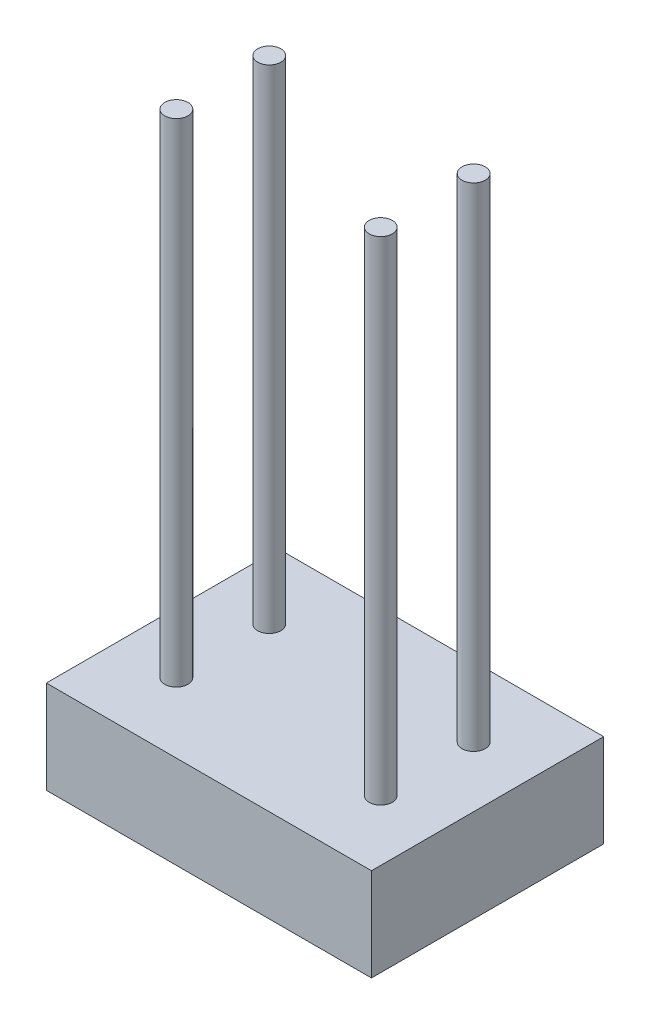
ISO-10303-21;
HEADER;
FILE_DESCRIPTION(('STEP AP214'),'2;1');
FILE_NAME('part.step','',(''),(''),'','','');
FILE_SCHEMA(('AUTOMOTIVE_DESIGN { 1 0 10303 214 1 1 1 1 }'));
ENDSEC;
DATA;
#1=APPLICATION_CONTEXT('core data for automotive mechanical design processes');
#2=APPLICATION_PROTOCOL_DEFINITION('international standard','automotive_design',2000,#1);
#3=PRODUCT_CONTEXT('',#1,'mechanical');
#4=PRODUCT('Part','Part','',(#3));
#5=PRODUCT_RELATED_PRODUCT_CATEGORY('part','',(#4));
#6=PRODUCT_DEFINITION_FORMATION('','',#4);
#7=PRODUCT_DEFINITION_CONTEXT('part definition',#1,'design');
#8=PRODUCT_DEFINITION('design','',#6,#7);
#9=PRODUCT_DEFINITION_SHAPE('','',#8);
#10=(LENGTH_UNIT() NAMED_UNIT(*) SI_UNIT(.MILLI.,.METRE.));
#11=(NAMED_UNIT(*) PLANE_ANGLE_UNIT() SI_UNIT($,.RADIAN.));
#12=(NAMED_UNIT(*) SI_UNIT($,.STERADIAN.) SOLID_ANGLE_UNIT());
#13=UNCERTAINTY_MEASURE_WITH_UNIT(LENGTH_MEASURE(1.E-05),#10,'distance_accuracy_value','');
#14=(GEOMETRIC_REPRESENTATION_CONTEXT(3) GLOBAL_UNCERTAINTY_ASSIGNED_CONTEXT((#13)) GLOBAL_UNIT_ASSIGNED_CONTEXT((#10,
#11,#12)) REPRESENTATION_CONTEXT('',''));
#15=CARTESIAN_POINT('',(0.,0.,0.));
#16=DIRECTION('',(0.,0.,1.));
#17=DIRECTION('',(1.,0.,0.));
#18=AXIS2_PLACEMENT_3D('',#15,#16,#17);
#19=CARTESIAN_POINT('',(175.,100.,-125.));
#20=DIRECTION('',(-1.,0.,0.));
#21=DIRECTION('',(0.,0.,1.));
#22=AXIS2_PLACEMENT_3D('',#19,#20,#21);
#23=PLANE('',#22);
#24=DIRECTION('',(0.,0.,-1.));
#25=VECTOR('',#24,1.);
#26=CARTESIAN_POINT('',(175.,0.,-125.));
#27=LINE('',#26,#25);
#28=CARTESIAN_POINT('',(175.,0.,125.));
#29=VERTEX_POINT('',#28);
#30=CARTESIAN_POINT('',(175.,0.,-125.));
#31=VERTEX_POINT('',#30);
#32=EDGE_CURVE('E101',#29,#31,#27,.T.);
#33=ORIENTED_EDGE('',*,*,#32,.T.);
#34=DIRECTION('',(0.,-1.,0.));
#35=VECTOR('',#34,1.);
#36=CARTESIAN_POINT('',(175.,100.,-125.));
#37=LINE('',#36,#35);
#38=CARTESIAN_POINT('',(175.,100.,-125.));
#39=VERTEX_POINT('',#38);
#40=EDGE_CURVE('E11',#39,#31,#37,.T.);
#41=ORIENTED_EDGE('',*,*,#40,.F.);
#42=DIRECTION('',(0.,0.,-1.));
#43=VECTOR('',#42,1.);
#44=CARTESIAN_POINT('',(175.,100.,-125.));
#45=LINE('',#44,#43);
#46=CARTESIAN_POINT('',(175.,100.,125.));
#47=VERTEX_POINT('',#46);
#48=EDGE_CURVE('E89',#47,#39,#45,.T.);
#49=ORIENTED_EDGE('',*,*,#48,.F.);
#50=DIRECTION('',(0.,-1.,0.));
#51=VECTOR('',#50,1.);
#52=CARTESIAN_POINT('',(175.,100.,125.));
#53=LINE('',#52,#51);
#54=EDGE_CURVE('E97',#47,#29,#53,.T.);
#55=ORIENTED_EDGE('',*,*,#54,.T.);
#56=EDGE_LOOP('',(#33,#41,#49,#55));
#57=FACE_BOUND('',#56,.T.);
#58=ADVANCED_FACE('F38',(#57),#23,.F.);
#59=CARTESIAN_POINT('',(-175.,100.,-125.));
#60=DIRECTION('',(0.,0.,1.));
#61=DIRECTION('',(1.,0.,0.));
#62=AXIS2_PLACEMENT_3D('',#59,#60,#61);
#63=PLANE('',#62);
#64=DIRECTION('',(-1.,0.,0.));
#65=VECTOR('',#64,1.);
#66=CARTESIAN_POINT('',(-175.,0.,-125.));
#67=LINE('',#66,#65);
#68=CARTESIAN_POINT('',(-175.,0.,-125.));
#69=VERTEX_POINT('',#68);
#70=EDGE_CURVE('E93',#31,#69,#67,.T.);
#71=ORIENTED_EDGE('',*,*,#70,.T.);
#72=DIRECTION('',(0.,-1.,0.));
#73=VECTOR('',#72,1.);
#74=CARTESIAN_POINT('',(-175.,100.,-125.));
#75=LINE('',#74,#73);
#76=CARTESIAN_POINT('',(-175.,100.,-125.));
#77=VERTEX_POINT('',#76);
#78=EDGE_CURVE('E46',#77,#69,#75,.T.);
#79=ORIENTED_EDGE('',*,*,#78,.F.);
#80=DIRECTION('',(-1.,0.,0.));
#81=VECTOR('',#80,1.);
#82=CARTESIAN_POINT('',(-175.,100.,-125.));
#83=LINE('',#82,#81);
#84=EDGE_CURVE('E84',#39,#77,#83,.T.);
#85=ORIENTED_EDGE('',*,*,#84,.F.);
#86=ORIENTED_EDGE('',*,*,#40,.T.);
#87=EDGE_LOOP('',(#71,#79,#85,#86));
#88=FACE_BOUND('',#87,.T.);
#89=ADVANCED_FACE('F92',(#88),#63,.F.);
#90=CARTESIAN_POINT('',(-175.,100.,-125.));
#91=DIRECTION('',(1.,0.,0.));
#92=DIRECTION('',(0.,0.,-1.));
#93=AXIS2_PLACEMENT_3D('',#90,#91,#92);
#94=PLANE('',#93);
#95=DIRECTION('',(0.,0.,1.));
#96=VECTOR('',#95,1.);
#97=CARTESIAN_POINT('',(-175.,0.,-125.));
#98=LINE('',#97,#96);
#99=CARTESIAN_POINT('',(-175.,0.,125.));
#100=VERTEX_POINT('',#99);
#101=EDGE_CURVE('E71',#69,#100,#98,.T.);
#102=ORIENTED_EDGE('',*,*,#101,.T.);
#103=DIRECTION('',(0.,-1.,0.));
#104=VECTOR('',#103,1.);
#105=CARTESIAN_POINT('',(-175.,100.,125.));
#106=LINE('',#105,#104);
#107=CARTESIAN_POINT('',(-175.,100.,125.));
#108=VERTEX_POINT('',#107);
#109=EDGE_CURVE('E94',#108,#100,#106,.T.);
#110=ORIENTED_EDGE('',*,*,#109,.F.);
#111=DIRECTION('',(0.,0.,1.));
#112=VECTOR('',#111,1.);
#113=CARTESIAN_POINT('',(-175.,100.,-125.));
#114=LINE('',#113,#112);
#115=EDGE_CURVE('E87',#77,#108,#114,.T.);
#116=ORIENTED_EDGE('',*,*,#115,.F.);
#117=ORIENTED_EDGE('',*,*,#78,.T.);
#118=EDGE_LOOP('',(#102,#110,#116,#117));
#119=FACE_BOUND('',#118,.T.);
#120=ADVANCED_FACE('F95',(#119),#94,.F.);
#121=CARTESIAN_POINT('',(-175.,100.,125.));
#122=DIRECTION('',(0.,0.,-1.));
#123=DIRECTION('',(-1.,0.,0.));
#124=AXIS2_PLACEMENT_3D('',#121,#122,#123);
#125=PLANE('',#124);
#126=DIRECTION('',(1.,0.,0.));
#127=VECTOR('',#126,1.);
#128=CARTESIAN_POINT('',(-175.,0.,125.));
#129=LINE('',#128,#127);
#130=EDGE_CURVE('E77',#100,#29,#129,.T.);
#131=ORIENTED_EDGE('',*,*,#130,.T.);
#132=ORIENTED_EDGE('',*,*,#54,.F.);
#133=DIRECTION('',(1.,0.,0.));
#134=VECTOR('',#133,1.);
#135=CARTESIAN_POINT('',(-175.,100.,125.));
#136=LINE('',#135,#134);
#137=EDGE_CURVE('E54',#108,#47,#136,.T.);
#138=ORIENTED_EDGE('',*,*,#137,.F.);
#139=ORIENTED_EDGE('',*,*,#109,.T.);
#140=EDGE_LOOP('',(#131,#132,#138,#139));
#141=FACE_BOUND('',#140,.T.);
#142=ADVANCED_FACE('F109',(#141),#125,.F.);
#143=CARTESIAN_POINT('',(0.,100.,0.));
#144=DIRECTION('',(0.,1.,0.));
#145=DIRECTION('',(0.,0.,1.));
#146=AXIS2_PLACEMENT_3D('',#143,#144,#145);
#147=PLANE('',#146);
#148=CARTESIAN_POINT('',(-110.,100.,50.));
#149=DIRECTION('',(0.,1.,0.));
#150=DIRECTION('',(0.,0.,-1.));
#151=AXIS2_PLACEMENT_3D('',#148,#149,#150);
#152=CIRCLE('',#151,12.5);
#153=CARTESIAN_POINT('',(-110.,100.,37.5));
#154=VERTEX_POINT('',#153);
#155=EDGE_CURVE('E133',#154,#154,#152,.T.);
#156=ORIENTED_EDGE('',*,*,#155,.F.);
#157=EDGE_LOOP('',(#156));
#158=FACE_BOUND('',#157,.T.);
#159=CARTESIAN_POINT('',(110.,100.,50.));
#160=DIRECTION('',(0.,1.,0.));
#161=DIRECTION('',(0.,0.,1.));
#162=AXIS2_PLACEMENT_3D('',#159,#160,#161);
#163=CIRCLE('',#162,12.5);
#164=CARTESIAN_POINT('',(110.,100.,62.5));
#165=VERTEX_POINT('',#164);
#166=EDGE_CURVE('E127',#165,#165,#163,.T.);
#167=ORIENTED_EDGE('',*,*,#166,.F.);
#168=EDGE_LOOP('',(#167));
#169=FACE_BOUND('',#168,.T.);
#170=CARTESIAN_POINT('',(110.,100.,-50.));
#171=DIRECTION('',(0.,1.,0.));
#172=DIRECTION('',(0.,0.,-1.));
#173=AXIS2_PLACEMENT_3D('',#170,#171,#172);
#174=CIRCLE('',#173,12.5);
#175=CARTESIAN_POINT('',(110.,100.,-62.5));
#176=VERTEX_POINT('',#175);
#177=EDGE_CURVE('E121',#176,#176,#174,.T.);
#178=ORIENTED_EDGE('',*,*,#177,.F.);
#179=EDGE_LOOP('',(#178));
#180=FACE_BOUND('',#179,.T.);
#181=CARTESIAN_POINT('',(-110.,100.,-50.));
#182=DIRECTION('',(0.,1.,0.));
#183=DIRECTION('',(0.,0.,1.));
#184=AXIS2_PLACEMENT_3D('',#181,#182,#183);
#185=CIRCLE('',#184,12.5);
#186=CARTESIAN_POINT('',(-110.,100.,-37.5));
#187=VERTEX_POINT('',#186);
#188=EDGE_CURVE('E115',#187,#187,#185,.T.);
#189=ORIENTED_EDGE('',*,*,#188,.F.);
#190=EDGE_LOOP('',(#189));
#191=FACE_BOUND('',#190,.T.);
#192=ORIENTED_EDGE('',*,*,#48,.T.);
#193=ORIENTED_EDGE('',*,*,#84,.T.);
#194=ORIENTED_EDGE('',*,*,#115,.T.);
#195=ORIENTED_EDGE('',*,*,#137,.T.);
#196=EDGE_LOOP('',(#192,#193,#194,#195));
#197=FACE_BOUND('',#196,.T.);
#198=ADVANCED_FACE('F85',(#158,#169,#180,#191,#197),#147,.T.);
#199=CARTESIAN_POINT('',(0.,0.,0.));
#200=DIRECTION('',(0.,1.,0.));
#201=DIRECTION('',(0.,0.,1.));
#202=AXIS2_PLACEMENT_3D('',#199,#200,#201);
#203=PLANE('',#202);
#204=ORIENTED_EDGE('',*,*,#32,.F.);
#205=ORIENTED_EDGE('',*,*,#130,.F.);
#206=ORIENTED_EDGE('',*,*,#101,.F.);
#207=ORIENTED_EDGE('',*,*,#70,.F.);
#208=EDGE_LOOP('',(#204,#205,#206,#207));
#209=FACE_BOUND('',#208,.T.);
#210=ADVANCED_FACE('F112',(#209),#203,.F.);
#211=CARTESIAN_POINT('',(-110.,630.,-50.));
#212=DIRECTION('',(0.,-1.,0.));
#213=DIRECTION('',(0.,0.,-1.));
#214=AXIS2_PLACEMENT_3D('',#211,#212,#213);
#215=CYLINDRICAL_SURFACE('',#214,12.5);
#216=CARTESIAN_POINT('',(-110.,630.,-50.));
#217=DIRECTION('',(0.,1.,0.));
#218=DIRECTION('',(0.,0.,1.));
#219=AXIS2_PLACEMENT_3D('',#216,#217,#218);
#220=CIRCLE('',#219,12.5);
#221=CARTESIAN_POINT('',(-110.,630.,-37.5));
#222=VERTEX_POINT('',#221);
#223=EDGE_CURVE('E104',#222,#222,#220,.T.);
#224=ORIENTED_EDGE('',*,*,#223,.F.);
#225=EDGE_LOOP('',(#224));
#226=FACE_BOUND('',#225,.T.);
#227=ORIENTED_EDGE('',*,*,#188,.T.);
#228=EDGE_LOOP('',(#227));
#229=FACE_BOUND('',#228,.T.);
#230=ADVANCED_FACE('F157',(#226,#229),#215,.T.);
#231=CARTESIAN_POINT('',(-110.,630.,-50.));
#232=DIRECTION('',(0.,1.,0.));
#233=DIRECTION('',(0.,0.,1.));
#234=AXIS2_PLACEMENT_3D('',#231,#232,#233);
#235=PLANE('',#234);
#236=ORIENTED_EDGE('',*,*,#223,.T.);
#237=EDGE_LOOP('',(#236));
#238=FACE_BOUND('',#237,.T.);
#239=ADVANCED_FACE('F159',(#238),#235,.T.);
#240=CARTESIAN_POINT('',(110.,630.,-50.));
#241=DIRECTION('',(0.,-1.,0.));
#242=DIRECTION('',(0.,0.,-1.));
#243=AXIS2_PLACEMENT_3D('',#240,#241,#242);
#244=CYLINDRICAL_SURFACE('',#243,12.5);
#245=CARTESIAN_POINT('',(110.,630.,-50.));
#246=DIRECTION('',(0.,1.,0.));
#247=DIRECTION('',(0.,0.,-1.));
#248=AXIS2_PLACEMENT_3D('',#245,#246,#247);
#249=CIRCLE('',#248,12.5);
#250=CARTESIAN_POINT('',(110.,630.,-62.5));
#251=VERTEX_POINT('',#250);
#252=EDGE_CURVE('E118',#251,#251,#249,.T.);
#253=ORIENTED_EDGE('',*,*,#252,.F.);
#254=EDGE_LOOP('',(#253));
#255=FACE_BOUND('',#254,.T.);
#256=ORIENTED_EDGE('',*,*,#177,.T.);
#257=EDGE_LOOP('',(#256));
#258=FACE_BOUND('',#257,.T.);
#259=ADVANCED_FACE('F166',(#255,#258),#244,.T.);
#260=CARTESIAN_POINT('',(110.,630.,-50.));
#261=DIRECTION('',(0.,-1.,0.));
#262=DIRECTION('',(0.,0.,-1.));
#263=AXIS2_PLACEMENT_3D('',#260,#261,#262);
#264=PLANE('',#263);
#265=ORIENTED_EDGE('',*,*,#252,.T.);
#266=EDGE_LOOP('',(#265));
#267=FACE_BOUND('',#266,.T.);
#268=ADVANCED_FACE('F214',(#267),#264,.F.);
#269=CARTESIAN_POINT('',(110.,630.,50.));
#270=DIRECTION('',(0.,-1.,0.));
#271=DIRECTION('',(0.,0.,-1.));
#272=AXIS2_PLACEMENT_3D('',#269,#270,#271);
#273=CYLINDRICAL_SURFACE('',#272,12.5);
#274=CARTESIAN_POINT('',(110.,630.,50.));
#275=DIRECTION('',(0.,1.,0.));
#276=DIRECTION('',(0.,0.,1.));
#277=AXIS2_PLACEMENT_3D('',#274,#275,#276);
#278=CIRCLE('',#277,12.5);
#279=CARTESIAN_POINT('',(110.,630.,62.5));
#280=VERTEX_POINT('',#279);
#281=EDGE_CURVE('E124',#280,#280,#278,.T.);
#282=ORIENTED_EDGE('',*,*,#281,.F.);
#283=EDGE_LOOP('',(#282));
#284=FACE_BOUND('',#283,.T.);
#285=ORIENTED_EDGE('',*,*,#166,.T.);
#286=EDGE_LOOP('',(#285));
#287=FACE_BOUND('',#286,.T.);
#288=ADVANCED_FACE('F223',(#284,#287),#273,.T.);
#289=CARTESIAN_POINT('',(110.,630.,50.));
#290=DIRECTION('',(0.,1.,0.));
#291=DIRECTION('',(0.,0.,1.));
#292=AXIS2_PLACEMENT_3D('',#289,#290,#291);
#293=PLANE('',#292);
#294=ORIENTED_EDGE('',*,*,#281,.T.);
#295=EDGE_LOOP('',(#294));
#296=FACE_BOUND('',#295,.T.);
#297=ADVANCED_FACE('F144',(#296),#293,.T.);
#298=CARTESIAN_POINT('',(-110.,630.,50.));
#299=DIRECTION('',(0.,-1.,0.));
#300=DIRECTION('',(0.,0.,-1.));
#301=AXIS2_PLACEMENT_3D('',#298,#299,#300);
#302=CYLINDRICAL_SURFACE('',#301,12.5);
#303=CARTESIAN_POINT('',(-110.,630.,50.));
#304=DIRECTION('',(0.,1.,0.));
#305=DIRECTION('',(0.,0.,-1.));
#306=AXIS2_PLACEMENT_3D('',#303,#304,#305);
#307=CIRCLE('',#306,12.5);
#308=CARTESIAN_POINT('',(-110.,630.,37.5));
#309=VERTEX_POINT('',#308);
#310=EDGE_CURVE('E130',#309,#309,#307,.T.);
#311=ORIENTED_EDGE('',*,*,#310,.F.);
#312=EDGE_LOOP('',(#311));
#313=FACE_BOUND('',#312,.T.);
#314=ORIENTED_EDGE('',*,*,#155,.T.);
#315=EDGE_LOOP('',(#314));
#316=FACE_BOUND('',#315,.T.);
#317=ADVANCED_FACE('F141',(#313,#316),#302,.T.);
#318=CARTESIAN_POINT('',(-110.,630.,50.));
#319=DIRECTION('',(0.,-1.,0.));
#320=DIRECTION('',(0.,0.,-1.));
#321=AXIS2_PLACEMENT_3D('',#318,#319,#320);
#322=PLANE('',#321);
#323=ORIENTED_EDGE('',*,*,#310,.T.);
#324=EDGE_LOOP('',(#323));
#325=FACE_BOUND('',#324,.T.);
#326=ADVANCED_FACE('F139',(#325),#322,.F.);
#327=CLOSED_SHELL('',(#58,#89,#120,#142,#198,#210,#230,#239,#259,#268,#288,#297,#317,#326));
#328=MANIFOLD_SOLID_BREP('B2',#327);
#329=ADVANCED_BREP_SHAPE_REPRESENTATION('',(#18,#328),#14);
#330=SHAPE_DEFINITION_REPRESENTATION(#9,#329);
ENDSEC;
END-ISO-10303-21;
